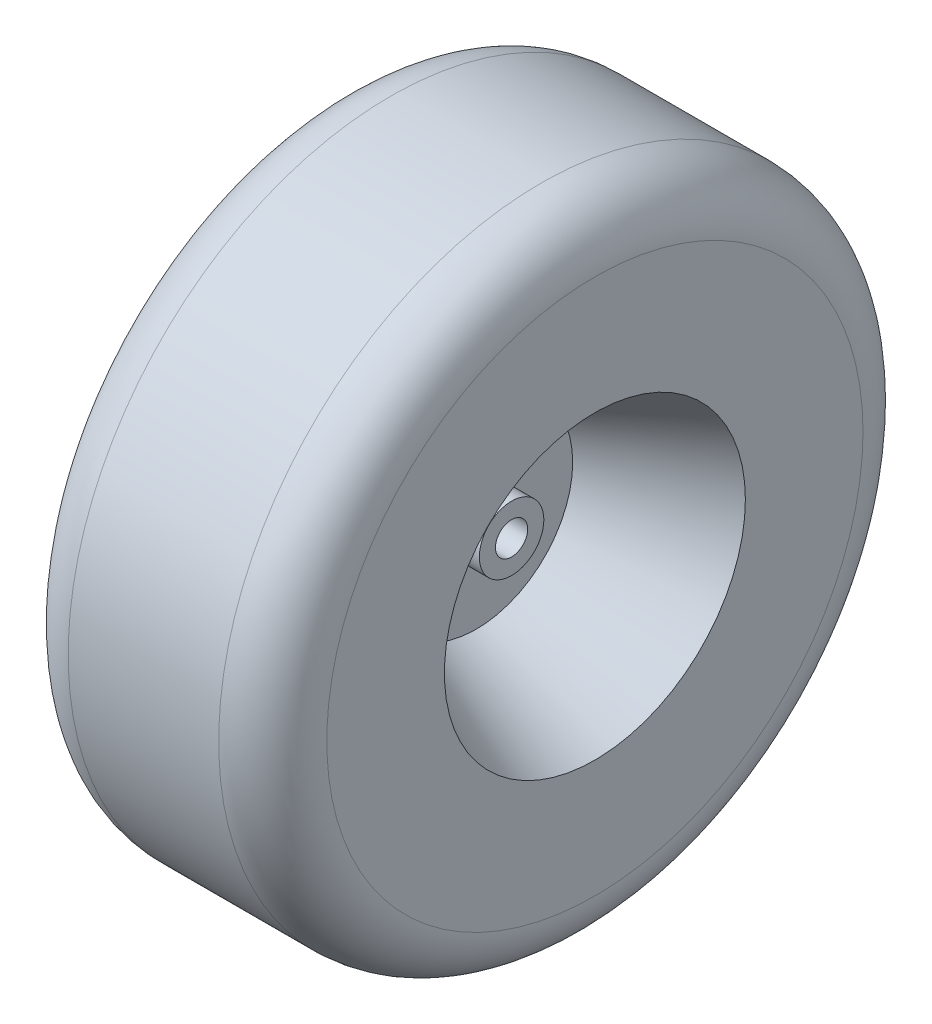
ISO-10303-21;
HEADER;
FILE_DESCRIPTION(('STEP AP214'),'2;1');
FILE_NAME('part.step','',(''),(''),'','','');
FILE_SCHEMA(('AUTOMOTIVE_DESIGN { 1 0 10303 214 1 1 1 1 }'));
ENDSEC;
DATA;
#1=APPLICATION_CONTEXT('core data for automotive mechanical design processes');
#2=APPLICATION_PROTOCOL_DEFINITION('international standard','automotive_design',2000,#1);
#3=PRODUCT_CONTEXT('',#1,'mechanical');
#4=PRODUCT('Part','Part','',(#3));
#5=PRODUCT_RELATED_PRODUCT_CATEGORY('part','',(#4));
#6=PRODUCT_DEFINITION_FORMATION('','',#4);
#7=PRODUCT_DEFINITION_CONTEXT('part definition',#1,'design');
#8=PRODUCT_DEFINITION('design','',#6,#7);
#9=PRODUCT_DEFINITION_SHAPE('','',#8);
#10=(LENGTH_UNIT() NAMED_UNIT(*) SI_UNIT(.MILLI.,.METRE.));
#11=(NAMED_UNIT(*) PLANE_ANGLE_UNIT() SI_UNIT($,.RADIAN.));
#12=(NAMED_UNIT(*) SI_UNIT($,.STERADIAN.) SOLID_ANGLE_UNIT());
#13=UNCERTAINTY_MEASURE_WITH_UNIT(LENGTH_MEASURE(1.E-05),#10,'distance_accuracy_value','');
#14=(GEOMETRIC_REPRESENTATION_CONTEXT(3) GLOBAL_UNCERTAINTY_ASSIGNED_CONTEXT((#13)) GLOBAL_UNIT_ASSIGNED_CONTEXT((#10,
#11,#12)) REPRESENTATION_CONTEXT('',''));
#15=CARTESIAN_POINT('',(0.,0.,0.));
#16=DIRECTION('',(0.,0.,1.));
#17=DIRECTION('',(1.,0.,0.));
#18=AXIS2_PLACEMENT_3D('',#15,#16,#17);
#19=CARTESIAN_POINT('',(76.2,88.9,0.));
#20=DIRECTION('',(-1.,0.,0.));
#21=DIRECTION('',(0.,0.,-1.));
#22=AXIS2_PLACEMENT_3D('',#19,#20,#21);
#23=PLANE('',#22);
#24=CARTESIAN_POINT('',(76.2,0.,0.));
#25=DIRECTION('',(1.,0.,0.));
#26=DIRECTION('',(0.,0.,-1.));
#27=AXIS2_PLACEMENT_3D('',#24,#25,#26);
#28=CIRCLE('',#27,158.372961578439);
#29=CARTESIAN_POINT('',(76.2,0.,-158.372961578439));
#30=VERTEX_POINT('',#29);
#31=EDGE_CURVE('E79',#30,#30,#28,.T.);
#32=ORIENTED_EDGE('',*,*,#31,.T.);
#33=EDGE_LOOP('',(#32));
#34=FACE_BOUND('',#33,.T.);
#35=CARTESIAN_POINT('',(76.2,0.,0.));
#36=DIRECTION('',(1.,0.,0.));
#37=DIRECTION('',(0.,0.,-1.));
#38=AXIS2_PLACEMENT_3D('',#35,#36,#37);
#39=CIRCLE('',#38,88.9);
#40=CARTESIAN_POINT('',(76.2,0.,-88.9));
#41=VERTEX_POINT('',#40);
#42=EDGE_CURVE('E10',#41,#41,#39,.T.);
#43=ORIENTED_EDGE('',*,*,#42,.F.);
#44=EDGE_LOOP('',(#43));
#45=FACE_BOUND('',#44,.T.);
#46=ADVANCED_FACE('F33',(#34,#45),#23,.F.);
#47=CARTESIAN_POINT('',(6.11263969154835,0.,0.));
#48=DIRECTION('',(1.,0.,0.));
#49=DIRECTION('',(0.,0.,1.));
#50=AXIS2_PLACEMENT_3D('',#47,#48,#49);
#51=CONICAL_SURFACE('',#50,56.9745874149852,0.427425630126478);
#52=ORIENTED_EDGE('',*,*,#42,.T.);
#53=EDGE_LOOP('',(#52));
#54=FACE_BOUND('',#53,.T.);
#55=CARTESIAN_POINT('',(6.11263969154835,0.,0.));
#56=DIRECTION('',(1.,0.,0.));
#57=DIRECTION('',(0.,0.,-1.));
#58=AXIS2_PLACEMENT_3D('',#55,#56,#57);
#59=CIRCLE('',#58,56.9745874149852);
#60=CARTESIAN_POINT('',(6.11263969154835,0.,-56.9745874149852));
#61=VERTEX_POINT('',#60);
#62=EDGE_CURVE('E39',#61,#61,#59,.T.);
#63=ORIENTED_EDGE('',*,*,#62,.F.);
#64=EDGE_LOOP('',(#63));
#65=FACE_BOUND('',#64,.T.);
#66=ADVANCED_FACE('F97',(#54,#65),#51,.F.);
#67=CARTESIAN_POINT('',(6.11263969154835,19.05,0.));
#68=DIRECTION('',(-1.,0.,0.));
#69=DIRECTION('',(0.,0.,-1.));
#70=AXIS2_PLACEMENT_3D('',#67,#68,#69);
#71=PLANE('',#70);
#72=ORIENTED_EDGE('',*,*,#62,.T.);
#73=EDGE_LOOP('',(#72));
#74=FACE_BOUND('',#73,.T.);
#75=CARTESIAN_POINT('',(6.11263969154835,0.,0.));
#76=DIRECTION('',(1.,0.,0.));
#77=DIRECTION('',(0.,0.,-1.));
#78=AXIS2_PLACEMENT_3D('',#75,#76,#77);
#79=CIRCLE('',#78,19.05);
#80=CARTESIAN_POINT('',(6.11263969154835,0.,-19.05));
#81=VERTEX_POINT('',#80);
#82=EDGE_CURVE('E43',#81,#81,#79,.T.);
#83=ORIENTED_EDGE('',*,*,#82,.F.);
#84=EDGE_LOOP('',(#83));
#85=FACE_BOUND('',#84,.T.);
#86=ADVANCED_FACE('F101',(#74,#85),#71,.F.);
#87=CARTESIAN_POINT('',(-76.2,0.,0.));
#88=DIRECTION('',(-1.,0.,0.));
#89=DIRECTION('',(0.,0.,-1.));
#90=AXIS2_PLACEMENT_3D('',#87,#88,#89);
#91=CYLINDRICAL_SURFACE('',#90,19.05);
#92=ORIENTED_EDGE('',*,*,#82,.T.);
#93=EDGE_LOOP('',(#92));
#94=FACE_BOUND('',#93,.T.);
#95=CARTESIAN_POINT('',(26.9875,0.,0.));
#96=DIRECTION('',(1.,0.,0.));
#97=DIRECTION('',(0.,0.,-1.));
#98=AXIS2_PLACEMENT_3D('',#95,#96,#97);
#99=CIRCLE('',#98,19.05);
#100=CARTESIAN_POINT('',(26.9875,0.,-19.05));
#101=VERTEX_POINT('',#100);
#102=EDGE_CURVE('E47',#101,#101,#99,.T.);
#103=ORIENTED_EDGE('',*,*,#102,.F.);
#104=EDGE_LOOP('',(#103));
#105=FACE_BOUND('',#104,.T.);
#106=ADVANCED_FACE('F105',(#94,#105),#91,.T.);
#107=CARTESIAN_POINT('',(26.9875,9.52500000000001,0.));
#108=DIRECTION('',(-1.,0.,0.));
#109=DIRECTION('',(0.,0.,-1.));
#110=AXIS2_PLACEMENT_3D('',#107,#108,#109);
#111=PLANE('',#110);
#112=ORIENTED_EDGE('',*,*,#102,.T.);
#113=EDGE_LOOP('',(#112));
#114=FACE_BOUND('',#113,.T.);
#115=CARTESIAN_POINT('',(26.9875,0.,0.));
#116=DIRECTION('',(1.,0.,0.));
#117=DIRECTION('',(0.,0.,-1.));
#118=AXIS2_PLACEMENT_3D('',#115,#116,#117);
#119=CIRCLE('',#118,9.52500000000001);
#120=CARTESIAN_POINT('',(26.9875,0.,-9.52500000000001));
#121=VERTEX_POINT('',#120);
#122=EDGE_CURVE('E52',#121,#121,#119,.T.);
#123=ORIENTED_EDGE('',*,*,#122,.F.);
#124=EDGE_LOOP('',(#123));
#125=FACE_BOUND('',#124,.T.);
#126=ADVANCED_FACE('F111',(#114,#125),#111,.F.);
#127=CARTESIAN_POINT('',(-76.2,0.,0.));
#128=DIRECTION('',(-1.,0.,0.));
#129=DIRECTION('',(0.,0.,-1.));
#130=AXIS2_PLACEMENT_3D('',#127,#128,#129);
#131=CYLINDRICAL_SURFACE('',#130,9.52500000000001);
#132=ORIENTED_EDGE('',*,*,#122,.T.);
#133=EDGE_LOOP('',(#132));
#134=FACE_BOUND('',#133,.T.);
#135=CARTESIAN_POINT('',(-26.9875,0.,0.));
#136=DIRECTION('',(1.,0.,0.));
#137=DIRECTION('',(0.,0.,-1.));
#138=AXIS2_PLACEMENT_3D('',#135,#136,#137);
#139=CIRCLE('',#138,9.52500000000001);
#140=CARTESIAN_POINT('',(-26.9875,0.,-9.52500000000001));
#141=VERTEX_POINT('',#140);
#142=EDGE_CURVE('E55',#141,#141,#139,.T.);
#143=ORIENTED_EDGE('',*,*,#142,.F.);
#144=EDGE_LOOP('',(#143));
#145=FACE_BOUND('',#144,.T.);
#146=ADVANCED_FACE('F115',(#134,#145),#131,.F.);
#147=CARTESIAN_POINT('',(-26.9875,9.52500000000001,0.));
#148=DIRECTION('',(1.,0.,0.));
#149=DIRECTION('',(0.,0.,1.));
#150=AXIS2_PLACEMENT_3D('',#147,#148,#149);
#151=PLANE('',#150);
#152=ORIENTED_EDGE('',*,*,#142,.T.);
#153=EDGE_LOOP('',(#152));
#154=FACE_BOUND('',#153,.T.);
#155=CARTESIAN_POINT('',(-26.9875,0.,0.));
#156=DIRECTION('',(1.,0.,0.));
#157=DIRECTION('',(0.,0.,-1.));
#158=AXIS2_PLACEMENT_3D('',#155,#156,#157);
#159=CIRCLE('',#158,19.05);
#160=CARTESIAN_POINT('',(-26.9875,0.,-19.05));
#161=VERTEX_POINT('',#160);
#162=EDGE_CURVE('E58',#161,#161,#159,.T.);
#163=ORIENTED_EDGE('',*,*,#162,.F.);
#164=EDGE_LOOP('',(#163));
#165=FACE_BOUND('',#164,.T.);
#166=ADVANCED_FACE('F119',(#154,#165),#151,.F.);
#167=CARTESIAN_POINT('',(-76.2,0.,0.));
#168=DIRECTION('',(-1.,0.,0.));
#169=DIRECTION('',(0.,0.,-1.));
#170=AXIS2_PLACEMENT_3D('',#167,#168,#169);
#171=CYLINDRICAL_SURFACE('',#170,19.05);
#172=ORIENTED_EDGE('',*,*,#162,.T.);
#173=EDGE_LOOP('',(#172));
#174=FACE_BOUND('',#173,.T.);
#175=CARTESIAN_POINT('',(-6.11263969154835,0.,0.));
#176=DIRECTION('',(1.,0.,0.));
#177=DIRECTION('',(0.,0.,-1.));
#178=AXIS2_PLACEMENT_3D('',#175,#176,#177);
#179=CIRCLE('',#178,19.05);
#180=CARTESIAN_POINT('',(-6.11263969154835,0.,-19.05));
#181=VERTEX_POINT('',#180);
#182=EDGE_CURVE('E61',#181,#181,#179,.T.);
#183=ORIENTED_EDGE('',*,*,#182,.F.);
#184=EDGE_LOOP('',(#183));
#185=FACE_BOUND('',#184,.T.);
#186=ADVANCED_FACE('F123',(#174,#185),#171,.T.);
#187=CARTESIAN_POINT('',(-6.11263969154835,19.05,0.));
#188=DIRECTION('',(1.,0.,0.));
#189=DIRECTION('',(0.,0.,1.));
#190=AXIS2_PLACEMENT_3D('',#187,#188,#189);
#191=PLANE('',#190);
#192=ORIENTED_EDGE('',*,*,#182,.T.);
#193=EDGE_LOOP('',(#192));
#194=FACE_BOUND('',#193,.T.);
#195=CARTESIAN_POINT('',(-6.11263969154835,0.,0.));
#196=DIRECTION('',(1.,0.,0.));
#197=DIRECTION('',(0.,0.,-1.));
#198=AXIS2_PLACEMENT_3D('',#195,#196,#197);
#199=CIRCLE('',#198,56.9745874149852);
#200=CARTESIAN_POINT('',(-6.11263969154835,0.,-56.9745874149852));
#201=VERTEX_POINT('',#200);
#202=EDGE_CURVE('E64',#201,#201,#199,.T.);
#203=ORIENTED_EDGE('',*,*,#202,.F.);
#204=EDGE_LOOP('',(#203));
#205=FACE_BOUND('',#204,.T.);
#206=ADVANCED_FACE('F127',(#194,#205),#191,.F.);
#207=CARTESIAN_POINT('',(-76.2,0.,0.));
#208=DIRECTION('',(-1.,0.,0.));
#209=DIRECTION('',(0.,0.,-1.));
#210=AXIS2_PLACEMENT_3D('',#207,#208,#209);
#211=CONICAL_SURFACE('',#210,88.9,0.427425630126478);
#212=ORIENTED_EDGE('',*,*,#202,.T.);
#213=EDGE_LOOP('',(#212));
#214=FACE_BOUND('',#213,.T.);
#215=CARTESIAN_POINT('',(-76.2,0.,0.));
#216=DIRECTION('',(1.,0.,0.));
#217=DIRECTION('',(0.,0.,-1.));
#218=AXIS2_PLACEMENT_3D('',#215,#216,#217);
#219=CIRCLE('',#218,88.9);
#220=CARTESIAN_POINT('',(-76.2,0.,-88.9));
#221=VERTEX_POINT('',#220);
#222=EDGE_CURVE('E67',#221,#221,#219,.T.);
#223=ORIENTED_EDGE('',*,*,#222,.F.);
#224=EDGE_LOOP('',(#223));
#225=FACE_BOUND('',#224,.T.);
#226=ADVANCED_FACE('F131',(#214,#225),#211,.F.);
#227=CARTESIAN_POINT('',(-76.2,88.9,0.));
#228=DIRECTION('',(1.,0.,0.));
#229=DIRECTION('',(0.,0.,1.));
#230=AXIS2_PLACEMENT_3D('',#227,#228,#229);
#231=PLANE('',#230);
#232=ORIENTED_EDGE('',*,*,#222,.T.);
#233=EDGE_LOOP('',(#232));
#234=FACE_BOUND('',#233,.T.);
#235=CARTESIAN_POINT('',(-76.2,0.,0.));
#236=DIRECTION('',(1.,0.,0.));
#237=DIRECTION('',(0.,0.,-1.));
#238=AXIS2_PLACEMENT_3D('',#235,#236,#237);
#239=CIRCLE('',#238,158.372961578439);
#240=CARTESIAN_POINT('',(-76.2,0.,-158.372961578439));
#241=VERTEX_POINT('',#240);
#242=EDGE_CURVE('E70',#241,#241,#239,.T.);
#243=ORIENTED_EDGE('',*,*,#242,.F.);
#244=EDGE_LOOP('',(#243));
#245=FACE_BOUND('',#244,.T.);
#246=ADVANCED_FACE('F135',(#234,#245),#231,.F.);
#247=CARTESIAN_POINT('',(-44.0729616546245,0.,0.));
#248=DIRECTION('',(-1.,0.,0.));
#249=DIRECTION('',(0.,0.,-1.));
#250=AXIS2_PLACEMENT_3D('',#247,#248,#249);
#251=TOROIDAL_SURFACE('',#250,158.375174088774,32.1270384215606);
#252=ORIENTED_EDGE('',*,*,#242,.T.);
#253=EDGE_LOOP('',(#252));
#254=FACE_BOUND('',#253,.T.);
#255=CARTESIAN_POINT('',(-44.45,0.,0.));
#256=DIRECTION('',(1.,0.,0.));
#257=DIRECTION('',(0.,0.,-1.));
#258=AXIS2_PLACEMENT_3D('',#255,#256,#257);
#259=CIRCLE('',#258,190.5);
#260=CARTESIAN_POINT('',(-44.45,0.,-190.5));
#261=VERTEX_POINT('',#260);
#262=EDGE_CURVE('E73',#261,#261,#259,.T.);
#263=ORIENTED_EDGE('',*,*,#262,.F.);
#264=EDGE_LOOP('',(#263));
#265=FACE_BOUND('',#264,.T.);
#266=ADVANCED_FACE('F93',(#254,#265),#251,.T.);
#267=CARTESIAN_POINT('',(-76.2,0.,0.));
#268=DIRECTION('',(-1.,0.,0.));
#269=DIRECTION('',(0.,0.,-1.));
#270=AXIS2_PLACEMENT_3D('',#267,#268,#269);
#271=CYLINDRICAL_SURFACE('',#270,190.5);
#272=ORIENTED_EDGE('',*,*,#262,.T.);
#273=EDGE_LOOP('',(#272));
#274=FACE_BOUND('',#273,.T.);
#275=CARTESIAN_POINT('',(44.45,0.,0.));
#276=DIRECTION('',(1.,0.,0.));
#277=DIRECTION('',(0.,0.,-1.));
#278=AXIS2_PLACEMENT_3D('',#275,#276,#277);
#279=CIRCLE('',#278,190.5);
#280=CARTESIAN_POINT('',(44.45,0.,-190.5));
#281=VERTEX_POINT('',#280);
#282=EDGE_CURVE('E76',#281,#281,#279,.T.);
#283=ORIENTED_EDGE('',*,*,#282,.F.);
#284=EDGE_LOOP('',(#283));
#285=FACE_BOUND('',#284,.T.);
#286=ADVANCED_FACE('F87',(#274,#285),#271,.T.);
#287=CARTESIAN_POINT('',(44.0729616546245,0.,0.));
#288=DIRECTION('',(-1.,0.,0.));
#289=DIRECTION('',(0.,0.,-1.));
#290=AXIS2_PLACEMENT_3D('',#287,#288,#289);
#291=TOROIDAL_SURFACE('',#290,158.375174088774,32.1270384215606);
#292=ORIENTED_EDGE('',*,*,#282,.T.);
#293=EDGE_LOOP('',(#292));
#294=FACE_BOUND('',#293,.T.);
#295=ORIENTED_EDGE('',*,*,#31,.F.);
#296=EDGE_LOOP('',(#295));
#297=FACE_BOUND('',#296,.T.);
#298=ADVANCED_FACE('F85',(#294,#297),#291,.T.);
#299=CLOSED_SHELL('',(#46,#66,#86,#106,#126,#146,#166,#186,#206,#226,#246,#266,#286,#298));
#300=MANIFOLD_SOLID_BREP('B2',#299);
#301=ADVANCED_BREP_SHAPE_REPRESENTATION('',(#18,#300),#14);
#302=SHAPE_DEFINITION_REPRESENTATION(#9,#301);
ENDSEC;
END-ISO-10303-21;
